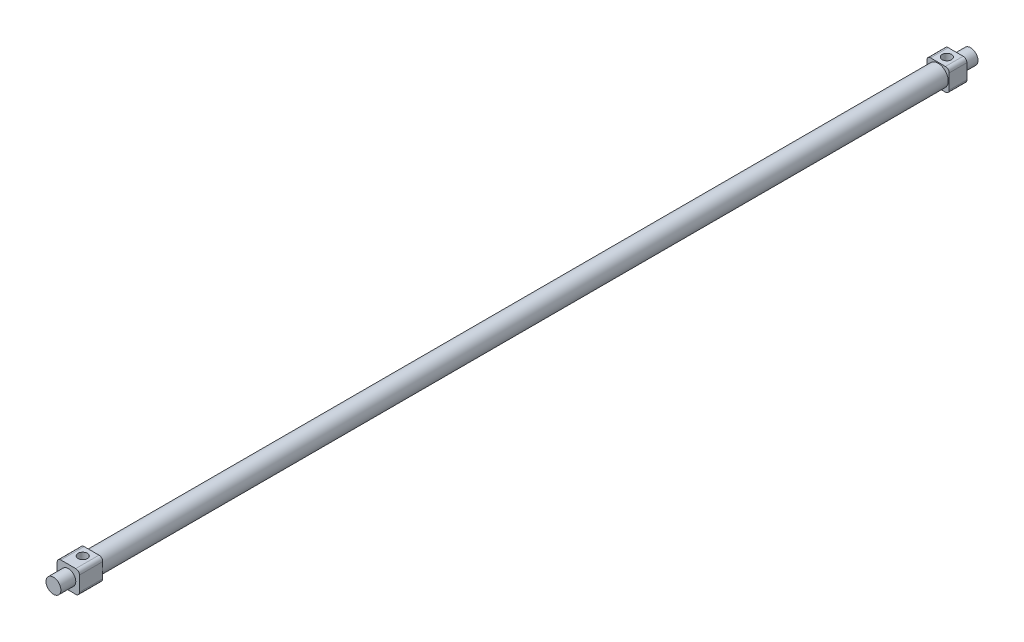
ISO-10303-21;
HEADER;
FILE_DESCRIPTION(('STEP AP214'),'2;1');
FILE_NAME('part.step','',(''),(''),'','','');
FILE_SCHEMA(('AUTOMOTIVE_DESIGN { 1 0 10303 214 1 1 1 1 }'));
ENDSEC;
DATA;
#1=APPLICATION_CONTEXT('core data for automotive mechanical design processes');
#2=APPLICATION_PROTOCOL_DEFINITION('international standard','automotive_design',2000,#1);
#3=PRODUCT_CONTEXT('',#1,'mechanical');
#4=PRODUCT('Part','Part','',(#3));
#5=PRODUCT_RELATED_PRODUCT_CATEGORY('part','',(#4));
#6=PRODUCT_DEFINITION_FORMATION('','',#4);
#7=PRODUCT_DEFINITION_CONTEXT('part definition',#1,'design');
#8=PRODUCT_DEFINITION('design','',#6,#7);
#9=PRODUCT_DEFINITION_SHAPE('','',#8);
#10=(LENGTH_UNIT() NAMED_UNIT(*) SI_UNIT(.MILLI.,.METRE.));
#11=(NAMED_UNIT(*) PLANE_ANGLE_UNIT() SI_UNIT($,.RADIAN.));
#12=(NAMED_UNIT(*) SI_UNIT($,.STERADIAN.) SOLID_ANGLE_UNIT());
#13=UNCERTAINTY_MEASURE_WITH_UNIT(LENGTH_MEASURE(1.E-05),#10,'distance_accuracy_value','');
#14=(GEOMETRIC_REPRESENTATION_CONTEXT(3) GLOBAL_UNCERTAINTY_ASSIGNED_CONTEXT((#13)) GLOBAL_UNIT_ASSIGNED_CONTEXT((#10,
#11,#12)) REPRESENTATION_CONTEXT('',''));
#15=CARTESIAN_POINT('',(0.,0.,0.));
#16=DIRECTION('',(0.,0.,1.));
#17=DIRECTION('',(1.,0.,0.));
#18=AXIS2_PLACEMENT_3D('',#15,#16,#17);
#19=CARTESIAN_POINT('',(0.,0.,477.));
#20=DIRECTION('',(0.,0.,-1.));
#21=DIRECTION('',(-1.,0.,0.));
#22=AXIS2_PLACEMENT_3D('',#19,#20,#21);
#23=PLANE('',#22);
#24=DIRECTION('',(0.,-1.,0.));
#25=VECTOR('',#24,1.);
#26=CARTESIAN_POINT('',(-6.,-6.,477.));
#27=LINE('',#26,#25);
#28=CARTESIAN_POINT('',(-6.,4.,477.));
#29=VERTEX_POINT('',#28);
#30=CARTESIAN_POINT('',(-6.,-4.,477.));
#31=VERTEX_POINT('',#30);
#32=EDGE_CURVE('E416',#29,#31,#27,.T.);
#33=ORIENTED_EDGE('',*,*,#32,.T.);
#34=CARTESIAN_POINT('',(-4.,-4.,477.));
#35=DIRECTION('',(0.,0.,-1.));
#36=DIRECTION('',(-1.,0.,0.));
#37=AXIS2_PLACEMENT_3D('',#34,#35,#36);
#38=CIRCLE('',#37,2.);
#39=CARTESIAN_POINT('',(-4.,-6.,477.));
#40=VERTEX_POINT('',#39);
#41=EDGE_CURVE('E250',#31,#40,#38,.F.);
#42=ORIENTED_EDGE('',*,*,#41,.T.);
#43=DIRECTION('',(1.,0.,0.));
#44=VECTOR('',#43,1.);
#45=CARTESIAN_POINT('',(-6.,-6.,477.));
#46=LINE('',#45,#44);
#47=CARTESIAN_POINT('',(4.,-6.,477.));
#48=VERTEX_POINT('',#47);
#49=EDGE_CURVE('E285',#40,#48,#46,.T.);
#50=ORIENTED_EDGE('',*,*,#49,.T.);
#51=CARTESIAN_POINT('',(4.,-4.,477.));
#52=DIRECTION('',(0.,0.,-1.));
#53=DIRECTION('',(-1.,0.,0.));
#54=AXIS2_PLACEMENT_3D('',#51,#52,#53);
#55=CIRCLE('',#54,2.);
#56=CARTESIAN_POINT('',(6.,-4.,477.));
#57=VERTEX_POINT('',#56);
#58=EDGE_CURVE('E248',#48,#57,#55,.F.);
#59=ORIENTED_EDGE('',*,*,#58,.T.);
#60=DIRECTION('',(0.,1.,0.));
#61=VECTOR('',#60,1.);
#62=CARTESIAN_POINT('',(6.,-6.,477.));
#63=LINE('',#62,#61);
#64=CARTESIAN_POINT('',(6.,4.,477.));
#65=VERTEX_POINT('',#64);
#66=EDGE_CURVE('E282',#57,#65,#63,.T.);
#67=ORIENTED_EDGE('',*,*,#66,.T.);
#68=CARTESIAN_POINT('',(4.,4.,477.));
#69=DIRECTION('',(0.,0.,-1.));
#70=DIRECTION('',(-1.,0.,0.));
#71=AXIS2_PLACEMENT_3D('',#68,#69,#70);
#72=CIRCLE('',#71,2.);
#73=CARTESIAN_POINT('',(4.,6.,477.));
#74=VERTEX_POINT('',#73);
#75=EDGE_CURVE('E62',#65,#74,#72,.F.);
#76=ORIENTED_EDGE('',*,*,#75,.T.);
#77=DIRECTION('',(-1.,0.,0.));
#78=VECTOR('',#77,1.);
#79=CARTESIAN_POINT('',(-6.,6.,477.));
#80=LINE('',#79,#78);
#81=CARTESIAN_POINT('',(-4.,6.,477.));
#82=VERTEX_POINT('',#81);
#83=EDGE_CURVE('E261',#74,#82,#80,.T.);
#84=ORIENTED_EDGE('',*,*,#83,.T.);
#85=CARTESIAN_POINT('',(-4.,4.,477.));
#86=DIRECTION('',(0.,0.,-1.));
#87=DIRECTION('',(-1.,0.,0.));
#88=AXIS2_PLACEMENT_3D('',#85,#86,#87);
#89=CIRCLE('',#88,2.);
#90=EDGE_CURVE('E245',#82,#29,#89,.F.);
#91=ORIENTED_EDGE('',*,*,#90,.T.);
#92=EDGE_LOOP('',(#33,#42,#50,#59,#67,#76,#84,#91));
#93=FACE_BOUND('',#92,.T.);
#94=CARTESIAN_POINT('',(0.,0.,477.));
#95=DIRECTION('',(0.,0.,-1.));
#96=DIRECTION('',(-1.,0.,0.));
#97=AXIS2_PLACEMENT_3D('',#94,#95,#96);
#98=CIRCLE('',#97,4.);
#99=CARTESIAN_POINT('',(-4.,0.,477.));
#100=VERTEX_POINT('',#99);
#101=EDGE_CURVE('E198',#100,#100,#98,.F.);
#102=ORIENTED_EDGE('',*,*,#101,.F.);
#103=EDGE_LOOP('',(#102));
#104=FACE_BOUND('',#103,.T.);
#105=ADVANCED_FACE('F39',(#93,#104),#23,.F.);
#106=CARTESIAN_POINT('',(0.,0.,9.5));
#107=DIRECTION('',(0.,0.,-1.));
#108=DIRECTION('',(-1.,0.,0.));
#109=AXIS2_PLACEMENT_3D('',#106,#107,#108);
#110=PLANE('',#109);
#111=DIRECTION('',(0.,1.,0.));
#112=VECTOR('',#111,1.);
#113=CARTESIAN_POINT('',(6.,-6.,9.5));
#114=LINE('',#113,#112);
#115=CARTESIAN_POINT('',(6.,-4.,9.5));
#116=VERTEX_POINT('',#115);
#117=CARTESIAN_POINT('',(6.,4.,9.5));
#118=VERTEX_POINT('',#117);
#119=EDGE_CURVE('E194',#116,#118,#114,.T.);
#120=ORIENTED_EDGE('',*,*,#119,.T.);
#121=CARTESIAN_POINT('',(4.,4.,9.5));
#122=DIRECTION('',(0.,0.,-1.));
#123=DIRECTION('',(-1.,0.,0.));
#124=AXIS2_PLACEMENT_3D('',#121,#122,#123);
#125=CIRCLE('',#124,2.);
#126=CARTESIAN_POINT('',(4.,6.,9.5));
#127=VERTEX_POINT('',#126);
#128=EDGE_CURVE('E215',#118,#127,#125,.F.);
#129=ORIENTED_EDGE('',*,*,#128,.T.);
#130=DIRECTION('',(-1.,0.,0.));
#131=VECTOR('',#130,1.);
#132=CARTESIAN_POINT('',(-6.,6.,9.5));
#133=LINE('',#132,#131);
#134=CARTESIAN_POINT('',(-4.,6.,9.5));
#135=VERTEX_POINT('',#134);
#136=EDGE_CURVE('E175',#127,#135,#133,.T.);
#137=ORIENTED_EDGE('',*,*,#136,.T.);
#138=CARTESIAN_POINT('',(-4.,4.,9.5));
#139=DIRECTION('',(0.,0.,-1.));
#140=DIRECTION('',(-1.,0.,0.));
#141=AXIS2_PLACEMENT_3D('',#138,#139,#140);
#142=CIRCLE('',#141,2.);
#143=CARTESIAN_POINT('',(-6.,4.,9.5));
#144=VERTEX_POINT('',#143);
#145=EDGE_CURVE('E211',#135,#144,#142,.F.);
#146=ORIENTED_EDGE('',*,*,#145,.T.);
#147=DIRECTION('',(0.,-1.,0.));
#148=VECTOR('',#147,1.);
#149=CARTESIAN_POINT('',(-6.,-6.,9.5));
#150=LINE('',#149,#148);
#151=CARTESIAN_POINT('',(-6.,-4.,9.5));
#152=VERTEX_POINT('',#151);
#153=EDGE_CURVE('E289',#144,#152,#150,.T.);
#154=ORIENTED_EDGE('',*,*,#153,.T.);
#155=CARTESIAN_POINT('',(-4.,-4.,9.5));
#156=DIRECTION('',(0.,0.,-1.));
#157=DIRECTION('',(-1.,0.,0.));
#158=AXIS2_PLACEMENT_3D('',#155,#156,#157);
#159=CIRCLE('',#158,2.);
#160=CARTESIAN_POINT('',(-4.,-6.,9.5));
#161=VERTEX_POINT('',#160);
#162=EDGE_CURVE('E209',#152,#161,#159,.F.);
#163=ORIENTED_EDGE('',*,*,#162,.T.);
#164=DIRECTION('',(1.,0.,0.));
#165=VECTOR('',#164,1.);
#166=CARTESIAN_POINT('',(-6.,-6.,9.5));
#167=LINE('',#166,#165);
#168=CARTESIAN_POINT('',(4.,-6.,9.5));
#169=VERTEX_POINT('',#168);
#170=EDGE_CURVE('E199',#161,#169,#167,.T.);
#171=ORIENTED_EDGE('',*,*,#170,.T.);
#172=CARTESIAN_POINT('',(4.,-4.,9.5));
#173=DIRECTION('',(0.,0.,-1.));
#174=DIRECTION('',(-1.,0.,0.));
#175=AXIS2_PLACEMENT_3D('',#172,#173,#174);
#176=CIRCLE('',#175,2.);
#177=EDGE_CURVE('E213',#169,#116,#176,.F.);
#178=ORIENTED_EDGE('',*,*,#177,.T.);
#179=EDGE_LOOP('',(#120,#129,#137,#146,#154,#163,#171,#178));
#180=FACE_BOUND('',#179,.T.);
#181=CARTESIAN_POINT('',(0.,0.,9.50000000000001));
#182=DIRECTION('',(0.,0.,-1.));
#183=DIRECTION('',(-1.,0.,0.));
#184=AXIS2_PLACEMENT_3D('',#181,#182,#183);
#185=CIRCLE('',#184,5.5);
#186=CARTESIAN_POINT('',(-5.5,0.,9.50000000000001));
#187=VERTEX_POINT('',#186);
#188=EDGE_CURVE('E195',#187,#187,#185,.F.);
#189=ORIENTED_EDGE('',*,*,#188,.F.);
#190=EDGE_LOOP('',(#189));
#191=FACE_BOUND('',#190,.T.);
#192=ADVANCED_FACE('F295',(#180,#191),#110,.F.);
#193=CARTESIAN_POINT('',(6.,-6.,9.5));
#194=DIRECTION('',(-1.,0.,0.));
#195=DIRECTION('',(0.,0.,1.));
#196=AXIS2_PLACEMENT_3D('',#193,#194,#195);
#197=PLANE('',#196);
#198=DIRECTION('',(0.,1.,0.));
#199=VECTOR('',#198,1.);
#200=CARTESIAN_POINT('',(6.,-6.,0.));
#201=LINE('',#200,#199);
#202=CARTESIAN_POINT('',(6.,-4.,0.));
#203=VERTEX_POINT('',#202);
#204=CARTESIAN_POINT('',(6.,4.,0.));
#205=VERTEX_POINT('',#204);
#206=EDGE_CURVE('E183',#203,#205,#201,.T.);
#207=ORIENTED_EDGE('',*,*,#206,.T.);
#208=DIRECTION('',(0.,0.,-1.));
#209=VECTOR('',#208,1.);
#210=CARTESIAN_POINT('',(6.,4.,9.5));
#211=LINE('',#210,#209);
#212=EDGE_CURVE('E160',#205,#118,#211,.F.);
#213=ORIENTED_EDGE('',*,*,#212,.T.);
#214=ORIENTED_EDGE('',*,*,#119,.F.);
#215=DIRECTION('',(0.,0.,-1.));
#216=VECTOR('',#215,1.);
#217=CARTESIAN_POINT('',(6.,-4.,9.5));
#218=LINE('',#217,#216);
#219=EDGE_CURVE('E165',#116,#203,#218,.T.);
#220=ORIENTED_EDGE('',*,*,#219,.T.);
#221=EDGE_LOOP('',(#207,#213,#214,#220));
#222=FACE_BOUND('',#221,.T.);
#223=ADVANCED_FACE('F306',(#222),#197,.F.);
#224=CARTESIAN_POINT('',(-6.,6.,9.5));
#225=DIRECTION('',(0.,-1.,0.));
#226=DIRECTION('',(0.,0.,-1.));
#227=AXIS2_PLACEMENT_3D('',#224,#225,#226);
#228=PLANE('',#227);
#229=CARTESIAN_POINT('',(0.,6.,4.75));
#230=DIRECTION('',(0.,1.,0.));
#231=DIRECTION('',(0.,0.,1.));
#232=AXIS2_PLACEMENT_3D('',#229,#230,#231);
#233=CIRCLE('',#232,2.5);
#234=CARTESIAN_POINT('',(0.,6.,7.25));
#235=VERTEX_POINT('',#234);
#236=EDGE_CURVE('E410',#235,#235,#233,.T.);
#237=ORIENTED_EDGE('',*,*,#236,.F.);
#238=EDGE_LOOP('',(#237));
#239=FACE_BOUND('',#238,.T.);
#240=ORIENTED_EDGE('',*,*,#136,.F.);
#241=DIRECTION('',(0.,0.,-1.));
#242=VECTOR('',#241,1.);
#243=CARTESIAN_POINT('',(4.,6.,9.5));
#244=LINE('',#243,#242);
#245=CARTESIAN_POINT('',(4.,6.,0.));
#246=VERTEX_POINT('',#245);
#247=EDGE_CURVE('E159',#127,#246,#244,.T.);
#248=ORIENTED_EDGE('',*,*,#247,.T.);
#249=DIRECTION('',(-1.,0.,0.));
#250=VECTOR('',#249,1.);
#251=CARTESIAN_POINT('',(-6.,6.,0.));
#252=LINE('',#251,#250);
#253=CARTESIAN_POINT('',(-4.,6.,0.));
#254=VERTEX_POINT('',#253);
#255=EDGE_CURVE('E172',#246,#254,#252,.T.);
#256=ORIENTED_EDGE('',*,*,#255,.T.);
#257=DIRECTION('',(0.,0.,-1.));
#258=VECTOR('',#257,1.);
#259=CARTESIAN_POINT('',(-4.,6.,9.5));
#260=LINE('',#259,#258);
#261=EDGE_CURVE('E177',#254,#135,#260,.F.);
#262=ORIENTED_EDGE('',*,*,#261,.T.);
#263=EDGE_LOOP('',(#240,#248,#256,#262));
#264=FACE_BOUND('',#263,.T.);
#265=ADVANCED_FACE('F171',(#239,#264),#228,.F.);
#266=CARTESIAN_POINT('',(-6.,-6.,9.5));
#267=DIRECTION('',(1.,0.,0.));
#268=DIRECTION('',(0.,0.,-1.));
#269=AXIS2_PLACEMENT_3D('',#266,#267,#268);
#270=PLANE('',#269);
#271=ORIENTED_EDGE('',*,*,#153,.F.);
#272=DIRECTION('',(0.,0.,-1.));
#273=VECTOR('',#272,1.);
#274=CARTESIAN_POINT('',(-6.,4.,9.5));
#275=LINE('',#274,#273);
#276=CARTESIAN_POINT('',(-6.,4.,0.));
#277=VERTEX_POINT('',#276);
#278=EDGE_CURVE('E224',#144,#277,#275,.T.);
#279=ORIENTED_EDGE('',*,*,#278,.T.);
#280=DIRECTION('',(0.,-1.,0.));
#281=VECTOR('',#280,1.);
#282=CARTESIAN_POINT('',(-6.,-6.,0.));
#283=LINE('',#282,#281);
#284=CARTESIAN_POINT('',(-6.,-4.,0.));
#285=VERTEX_POINT('',#284);
#286=EDGE_CURVE('E182',#277,#285,#283,.T.);
#287=ORIENTED_EDGE('',*,*,#286,.T.);
#288=DIRECTION('',(0.,0.,-1.));
#289=VECTOR('',#288,1.);
#290=CARTESIAN_POINT('',(-6.,-4.,9.5));
#291=LINE('',#290,#289);
#292=EDGE_CURVE('E222',#285,#152,#291,.F.);
#293=ORIENTED_EDGE('',*,*,#292,.T.);
#294=EDGE_LOOP('',(#271,#279,#287,#293));
#295=FACE_BOUND('',#294,.T.);
#296=ADVANCED_FACE('F314',(#295),#270,.F.);
#297=CARTESIAN_POINT('',(-6.,-6.,9.5));
#298=DIRECTION('',(0.,1.,0.));
#299=DIRECTION('',(0.,0.,1.));
#300=AXIS2_PLACEMENT_3D('',#297,#298,#299);
#301=PLANE('',#300);
#302=DIRECTION('',(1.,0.,0.));
#303=VECTOR('',#302,1.);
#304=CARTESIAN_POINT('',(-6.,-6.,0.));
#305=LINE('',#304,#303);
#306=CARTESIAN_POINT('',(-4.,-6.,0.));
#307=VERTEX_POINT('',#306);
#308=CARTESIAN_POINT('',(4.,-6.,0.));
#309=VERTEX_POINT('',#308);
#310=EDGE_CURVE('E186',#307,#309,#305,.T.);
#311=ORIENTED_EDGE('',*,*,#310,.T.);
#312=DIRECTION('',(0.,0.,-1.));
#313=VECTOR('',#312,1.);
#314=CARTESIAN_POINT('',(4.,-6.,9.5));
#315=LINE('',#314,#313);
#316=EDGE_CURVE('E220',#309,#169,#315,.F.);
#317=ORIENTED_EDGE('',*,*,#316,.T.);
#318=ORIENTED_EDGE('',*,*,#170,.F.);
#319=DIRECTION('',(0.,0.,-1.));
#320=VECTOR('',#319,1.);
#321=CARTESIAN_POINT('',(-4.,-6.,9.5));
#322=LINE('',#321,#320);
#323=EDGE_CURVE('E217',#161,#307,#322,.T.);
#324=ORIENTED_EDGE('',*,*,#323,.T.);
#325=EDGE_LOOP('',(#311,#317,#318,#324));
#326=FACE_BOUND('',#325,.T.);
#327=ADVANCED_FACE('F308',(#326),#301,.F.);
#328=CARTESIAN_POINT('',(0.,0.,0.));
#329=DIRECTION('',(0.,0.,-1.));
#330=DIRECTION('',(-1.,0.,0.));
#331=AXIS2_PLACEMENT_3D('',#328,#329,#330);
#332=PLANE('',#331);
#333=CARTESIAN_POINT('',(0.,0.,0.));
#334=DIRECTION('',(0.,0.,-1.));
#335=DIRECTION('',(-1.,0.,0.));
#336=AXIS2_PLACEMENT_3D('',#333,#334,#335);
#337=CIRCLE('',#336,4.);
#338=CARTESIAN_POINT('',(-4.,0.,0.));
#339=VERTEX_POINT('',#338);
#340=EDGE_CURVE('E11',#339,#339,#337,.T.);
#341=ORIENTED_EDGE('',*,*,#340,.F.);
#342=EDGE_LOOP('',(#341));
#343=FACE_BOUND('',#342,.T.);
#344=ORIENTED_EDGE('',*,*,#255,.F.);
#345=CARTESIAN_POINT('',(4.,4.,0.));
#346=DIRECTION('',(0.,0.,-1.));
#347=DIRECTION('',(-1.,0.,0.));
#348=AXIS2_PLACEMENT_3D('',#345,#346,#347);
#349=CIRCLE('',#348,2.);
#350=EDGE_CURVE('E155',#246,#205,#349,.T.);
#351=ORIENTED_EDGE('',*,*,#350,.T.);
#352=ORIENTED_EDGE('',*,*,#206,.F.);
#353=CARTESIAN_POINT('',(4.,-4.,0.));
#354=DIRECTION('',(0.,0.,-1.));
#355=DIRECTION('',(-1.,0.,0.));
#356=AXIS2_PLACEMENT_3D('',#353,#354,#355);
#357=CIRCLE('',#356,2.);
#358=EDGE_CURVE('E166',#203,#309,#357,.T.);
#359=ORIENTED_EDGE('',*,*,#358,.T.);
#360=ORIENTED_EDGE('',*,*,#310,.F.);
#361=CARTESIAN_POINT('',(-4.,-4.,0.));
#362=DIRECTION('',(0.,0.,-1.));
#363=DIRECTION('',(-1.,0.,0.));
#364=AXIS2_PLACEMENT_3D('',#361,#362,#363);
#365=CIRCLE('',#364,2.);
#366=EDGE_CURVE('E176',#307,#285,#365,.T.);
#367=ORIENTED_EDGE('',*,*,#366,.T.);
#368=ORIENTED_EDGE('',*,*,#286,.F.);
#369=CARTESIAN_POINT('',(-4.,4.,0.));
#370=DIRECTION('',(0.,0.,-1.));
#371=DIRECTION('',(-1.,0.,0.));
#372=AXIS2_PLACEMENT_3D('',#369,#370,#371);
#373=CIRCLE('',#372,2.);
#374=EDGE_CURVE('E181',#277,#254,#373,.T.);
#375=ORIENTED_EDGE('',*,*,#374,.T.);
#376=EDGE_LOOP('',(#344,#351,#352,#359,#360,#367,#368,#375));
#377=FACE_BOUND('',#376,.T.);
#378=ADVANCED_FACE('F179',(#343,#377),#332,.T.);
#379=CARTESIAN_POINT('',(0.,0.,464.5));
#380=DIRECTION('',(0.,0.,-1.));
#381=DIRECTION('',(-1.,0.,0.));
#382=AXIS2_PLACEMENT_3D('',#379,#380,#381);
#383=CYLINDRICAL_SURFACE('',#382,5.5);
#384=CARTESIAN_POINT('',(0.,0.,464.5));
#385=DIRECTION('',(0.,0.,1.));
#386=DIRECTION('',(1.,0.,0.));
#387=AXIS2_PLACEMENT_3D('',#384,#385,#386);
#388=CIRCLE('',#387,5.5);
#389=CARTESIAN_POINT('',(5.5,0.,464.5));
#390=VERTEX_POINT('',#389);
#391=EDGE_CURVE('E188',#390,#390,#388,.T.);
#392=ORIENTED_EDGE('',*,*,#391,.F.);
#393=EDGE_LOOP('',(#392));
#394=FACE_BOUND('',#393,.T.);
#395=ORIENTED_EDGE('',*,*,#188,.T.);
#396=EDGE_LOOP('',(#395));
#397=FACE_BOUND('',#396,.T.);
#398=ADVANCED_FACE('F343',(#394,#397),#383,.T.);
#399=CARTESIAN_POINT('',(0.,0.,464.5));
#400=DIRECTION('',(0.,0.,-1.));
#401=DIRECTION('',(-1.,0.,0.));
#402=AXIS2_PLACEMENT_3D('',#399,#400,#401);
#403=PLANE('',#402);
#404=DIRECTION('',(1.,0.,0.));
#405=VECTOR('',#404,1.);
#406=CARTESIAN_POINT('',(-6.,-6.,464.5));
#407=LINE('',#406,#405);
#408=CARTESIAN_POINT('',(-4.,-6.,464.5));
#409=VERTEX_POINT('',#408);
#410=CARTESIAN_POINT('',(4.,-6.,464.5));
#411=VERTEX_POINT('',#410);
#412=EDGE_CURVE('E274',#409,#411,#407,.T.);
#413=ORIENTED_EDGE('',*,*,#412,.F.);
#414=CARTESIAN_POINT('',(-4.,-4.,464.5));
#415=DIRECTION('',(0.,0.,-1.));
#416=DIRECTION('',(-1.,0.,0.));
#417=AXIS2_PLACEMENT_3D('',#414,#415,#416);
#418=CIRCLE('',#417,2.);
#419=CARTESIAN_POINT('',(-6.,-4.,464.5));
#420=VERTEX_POINT('',#419);
#421=EDGE_CURVE('E238',#409,#420,#418,.T.);
#422=ORIENTED_EDGE('',*,*,#421,.T.);
#423=DIRECTION('',(0.,-1.,0.));
#424=VECTOR('',#423,1.);
#425=CARTESIAN_POINT('',(-6.,-6.,464.5));
#426=LINE('',#425,#424);
#427=CARTESIAN_POINT('',(-6.,4.,464.5));
#428=VERTEX_POINT('',#427);
#429=EDGE_CURVE('E270',#428,#420,#426,.T.);
#430=ORIENTED_EDGE('',*,*,#429,.F.);
#431=CARTESIAN_POINT('',(-4.,4.,464.5));
#432=DIRECTION('',(0.,0.,-1.));
#433=DIRECTION('',(-1.,0.,0.));
#434=AXIS2_PLACEMENT_3D('',#431,#432,#433);
#435=CIRCLE('',#434,2.);
#436=CARTESIAN_POINT('',(-4.,6.,464.5));
#437=VERTEX_POINT('',#436);
#438=EDGE_CURVE('E232',#428,#437,#435,.T.);
#439=ORIENTED_EDGE('',*,*,#438,.T.);
#440=DIRECTION('',(-1.,0.,0.));
#441=VECTOR('',#440,1.);
#442=CARTESIAN_POINT('',(-6.,6.,464.5));
#443=LINE('',#442,#441);
#444=CARTESIAN_POINT('',(4.,6.,464.5));
#445=VERTEX_POINT('',#444);
#446=EDGE_CURVE('E260',#445,#437,#443,.T.);
#447=ORIENTED_EDGE('',*,*,#446,.F.);
#448=CARTESIAN_POINT('',(4.,4.,464.5));
#449=DIRECTION('',(0.,0.,-1.));
#450=DIRECTION('',(-1.,0.,0.));
#451=AXIS2_PLACEMENT_3D('',#448,#449,#450);
#452=CIRCLE('',#451,2.);
#453=CARTESIAN_POINT('',(6.,4.,464.5));
#454=VERTEX_POINT('',#453);
#455=EDGE_CURVE('E234',#445,#454,#452,.T.);
#456=ORIENTED_EDGE('',*,*,#455,.T.);
#457=DIRECTION('',(0.,1.,0.));
#458=VECTOR('',#457,1.);
#459=CARTESIAN_POINT('',(6.,-6.,464.5));
#460=LINE('',#459,#458);
#461=CARTESIAN_POINT('',(6.,-4.,464.5));
#462=VERTEX_POINT('',#461);
#463=EDGE_CURVE('E271',#462,#454,#460,.T.);
#464=ORIENTED_EDGE('',*,*,#463,.F.);
#465=CARTESIAN_POINT('',(4.,-4.,464.5));
#466=DIRECTION('',(0.,0.,-1.));
#467=DIRECTION('',(-1.,0.,0.));
#468=AXIS2_PLACEMENT_3D('',#465,#466,#467);
#469=CIRCLE('',#468,2.);
#470=EDGE_CURVE('E236',#462,#411,#469,.T.);
#471=ORIENTED_EDGE('',*,*,#470,.T.);
#472=EDGE_LOOP('',(#413,#422,#430,#439,#447,#456,#464,#471));
#473=FACE_BOUND('',#472,.T.);
#474=ORIENTED_EDGE('',*,*,#391,.T.);
#475=EDGE_LOOP('',(#474));
#476=FACE_BOUND('',#475,.T.);
#477=ADVANCED_FACE('F265',(#473,#476),#403,.T.);
#478=CARTESIAN_POINT('',(6.,-6.,477.));
#479=DIRECTION('',(-1.,0.,0.));
#480=DIRECTION('',(0.,0.,1.));
#481=AXIS2_PLACEMENT_3D('',#478,#479,#480);
#482=PLANE('',#481);
#483=ORIENTED_EDGE('',*,*,#66,.F.);
#484=DIRECTION('',(0.,0.,-1.));
#485=VECTOR('',#484,1.);
#486=CARTESIAN_POINT('',(6.,-4.,477.));
#487=LINE('',#486,#485);
#488=EDGE_CURVE('E254',#57,#462,#487,.T.);
#489=ORIENTED_EDGE('',*,*,#488,.T.);
#490=ORIENTED_EDGE('',*,*,#463,.T.);
#491=DIRECTION('',(0.,0.,-1.));
#492=VECTOR('',#491,1.);
#493=CARTESIAN_POINT('',(6.,4.,477.));
#494=LINE('',#493,#492);
#495=EDGE_CURVE('E252',#454,#65,#494,.F.);
#496=ORIENTED_EDGE('',*,*,#495,.T.);
#497=EDGE_LOOP('',(#483,#489,#490,#496));
#498=FACE_BOUND('',#497,.T.);
#499=ADVANCED_FACE('F342',(#498),#482,.F.);
#500=CARTESIAN_POINT('',(-6.,6.,477.));
#501=DIRECTION('',(0.,-1.,0.));
#502=DIRECTION('',(0.,0.,-1.));
#503=AXIS2_PLACEMENT_3D('',#500,#501,#502);
#504=PLANE('',#503);
#505=CARTESIAN_POINT('',(0.,6.,469.25));
#506=DIRECTION('',(0.,1.,0.));
#507=DIRECTION('',(0.,0.,1.));
#508=AXIS2_PLACEMENT_3D('',#505,#506,#507);
#509=CIRCLE('',#508,2.5);
#510=CARTESIAN_POINT('',(0.,6.,471.75));
#511=VERTEX_POINT('',#510);
#512=EDGE_CURVE('E496',#511,#511,#509,.T.);
#513=ORIENTED_EDGE('',*,*,#512,.F.);
#514=EDGE_LOOP('',(#513));
#515=FACE_BOUND('',#514,.T.);
#516=ORIENTED_EDGE('',*,*,#83,.F.);
#517=DIRECTION('',(0.,0.,-1.));
#518=VECTOR('',#517,1.);
#519=CARTESIAN_POINT('',(4.,6.,477.));
#520=LINE('',#519,#518);
#521=EDGE_CURVE('E43',#74,#445,#520,.T.);
#522=ORIENTED_EDGE('',*,*,#521,.T.);
#523=ORIENTED_EDGE('',*,*,#446,.T.);
#524=DIRECTION('',(0.,0.,-1.));
#525=VECTOR('',#524,1.);
#526=CARTESIAN_POINT('',(-4.,6.,477.));
#527=LINE('',#526,#525);
#528=EDGE_CURVE('E55',#437,#82,#527,.F.);
#529=ORIENTED_EDGE('',*,*,#528,.T.);
#530=EDGE_LOOP('',(#516,#522,#523,#529));
#531=FACE_BOUND('',#530,.T.);
#532=ADVANCED_FACE('F259',(#515,#531),#504,.F.);
#533=CARTESIAN_POINT('',(-6.,-6.,477.));
#534=DIRECTION('',(1.,0.,0.));
#535=DIRECTION('',(0.,0.,-1.));
#536=AXIS2_PLACEMENT_3D('',#533,#534,#535);
#537=PLANE('',#536);
#538=ORIENTED_EDGE('',*,*,#429,.T.);
#539=DIRECTION('',(0.,0.,-1.));
#540=VECTOR('',#539,1.);
#541=CARTESIAN_POINT('',(-6.,-4.,477.));
#542=LINE('',#541,#540);
#543=EDGE_CURVE('E243',#420,#31,#542,.F.);
#544=ORIENTED_EDGE('',*,*,#543,.T.);
#545=ORIENTED_EDGE('',*,*,#32,.F.);
#546=DIRECTION('',(0.,0.,-1.));
#547=VECTOR('',#546,1.);
#548=CARTESIAN_POINT('',(-6.,4.,477.));
#549=LINE('',#548,#547);
#550=EDGE_CURVE('E240',#29,#428,#549,.T.);
#551=ORIENTED_EDGE('',*,*,#550,.T.);
#552=EDGE_LOOP('',(#538,#544,#545,#551));
#553=FACE_BOUND('',#552,.T.);
#554=ADVANCED_FACE('F347',(#553),#537,.F.);
#555=CARTESIAN_POINT('',(-6.,-6.,477.));
#556=DIRECTION('',(0.,1.,0.));
#557=DIRECTION('',(0.,0.,1.));
#558=AXIS2_PLACEMENT_3D('',#555,#556,#557);
#559=PLANE('',#558);
#560=ORIENTED_EDGE('',*,*,#49,.F.);
#561=DIRECTION('',(0.,0.,-1.));
#562=VECTOR('',#561,1.);
#563=CARTESIAN_POINT('',(-4.,-6.,477.));
#564=LINE('',#563,#562);
#565=EDGE_CURVE('E229',#40,#409,#564,.T.);
#566=ORIENTED_EDGE('',*,*,#565,.T.);
#567=ORIENTED_EDGE('',*,*,#412,.T.);
#568=DIRECTION('',(0.,0.,-1.));
#569=VECTOR('',#568,1.);
#570=CARTESIAN_POINT('',(4.,-6.,477.));
#571=LINE('',#570,#569);
#572=EDGE_CURVE('E227',#411,#48,#571,.F.);
#573=ORIENTED_EDGE('',*,*,#572,.T.);
#574=EDGE_LOOP('',(#560,#566,#567,#573));
#575=FACE_BOUND('',#574,.T.);
#576=ADVANCED_FACE('F344',(#575),#559,.F.);
#577=CARTESIAN_POINT('',(0.,0.,485.));
#578=DIRECTION('',(0.,0.,-1.));
#579=DIRECTION('',(-1.,0.,0.));
#580=AXIS2_PLACEMENT_3D('',#577,#578,#579);
#581=CYLINDRICAL_SURFACE('',#580,4.);
#582=CARTESIAN_POINT('',(0.,0.,485.));
#583=DIRECTION('',(0.,0.,1.));
#584=DIRECTION('',(1.,0.,0.));
#585=AXIS2_PLACEMENT_3D('',#582,#583,#584);
#586=CIRCLE('',#585,4.);
#587=CARTESIAN_POINT('',(4.,0.,485.));
#588=VERTEX_POINT('',#587);
#589=EDGE_CURVE('E276',#588,#588,#586,.T.);
#590=ORIENTED_EDGE('',*,*,#589,.F.);
#591=EDGE_LOOP('',(#590));
#592=FACE_BOUND('',#591,.T.);
#593=ORIENTED_EDGE('',*,*,#101,.T.);
#594=EDGE_LOOP('',(#593));
#595=FACE_BOUND('',#594,.T.);
#596=ADVANCED_FACE('F338',(#592,#595),#581,.T.);
#597=CARTESIAN_POINT('',(0.,0.,485.));
#598=DIRECTION('',(0.,0.,1.));
#599=DIRECTION('',(1.,0.,0.));
#600=AXIS2_PLACEMENT_3D('',#597,#598,#599);
#601=PLANE('',#600);
#602=ORIENTED_EDGE('',*,*,#589,.T.);
#603=EDGE_LOOP('',(#602));
#604=FACE_BOUND('',#603,.T.);
#605=ADVANCED_FACE('F397',(#604),#601,.T.);
#606=CARTESIAN_POINT('',(0.,-7.07106781186548,4.75));
#607=DIRECTION('',(0.,1.,0.));
#608=DIRECTION('',(0.,0.,1.));
#609=AXIS2_PLACEMENT_3D('',#606,#607,#608);
#610=CYLINDRICAL_SURFACE('',#609,2.5);
#611=CARTESIAN_POINT('',(0.,0.,4.75));
#612=DIRECTION('',(0.,1.,0.));
#613=DIRECTION('',(0.,0.,1.));
#614=AXIS2_PLACEMENT_3D('',#611,#612,#613);
#615=CIRCLE('',#614,2.5);
#616=CARTESIAN_POINT('',(0.,0.,7.25));
#617=VERTEX_POINT('',#616);
#618=EDGE_CURVE('E407',#617,#617,#615,.F.);
#619=ORIENTED_EDGE('',*,*,#618,.T.);
#620=EDGE_LOOP('',(#619));
#621=FACE_BOUND('',#620,.T.);
#622=ORIENTED_EDGE('',*,*,#236,.T.);
#623=EDGE_LOOP('',(#622));
#624=FACE_BOUND('',#623,.T.);
#625=ADVANCED_FACE('F394',(#621,#624),#610,.F.);
#626=CARTESIAN_POINT('',(0.,0.,0.));
#627=DIRECTION('',(0.,1.,0.));
#628=DIRECTION('',(0.,0.,1.));
#629=AXIS2_PLACEMENT_3D('',#626,#627,#628);
#630=PLANE('',#629);
#631=ORIENTED_EDGE('',*,*,#618,.F.);
#632=EDGE_LOOP('',(#631));
#633=FACE_BOUND('',#632,.T.);
#634=ADVANCED_FACE('F384',(#633),#630,.T.);
#635=CARTESIAN_POINT('',(0.,-7.07106781186548,469.25));
#636=DIRECTION('',(0.,1.,0.));
#637=DIRECTION('',(0.,0.,1.));
#638=AXIS2_PLACEMENT_3D('',#635,#636,#637);
#639=CYLINDRICAL_SURFACE('',#638,2.5);
#640=CARTESIAN_POINT('',(0.,0.,469.25));
#641=DIRECTION('',(0.,1.,0.));
#642=DIRECTION('',(0.,0.,1.));
#643=AXIS2_PLACEMENT_3D('',#640,#641,#642);
#644=CIRCLE('',#643,2.5);
#645=CARTESIAN_POINT('',(0.,0.,471.75));
#646=VERTEX_POINT('',#645);
#647=EDGE_CURVE('E499',#646,#646,#644,.F.);
#648=ORIENTED_EDGE('',*,*,#647,.T.);
#649=EDGE_LOOP('',(#648));
#650=FACE_BOUND('',#649,.T.);
#651=ORIENTED_EDGE('',*,*,#512,.T.);
#652=EDGE_LOOP('',(#651));
#653=FACE_BOUND('',#652,.T.);
#654=ADVANCED_FACE('F378',(#650,#653),#639,.F.);
#655=CARTESIAN_POINT('',(0.,0.,0.));
#656=DIRECTION('',(0.,1.,0.));
#657=DIRECTION('',(0.,0.,1.));
#658=AXIS2_PLACEMENT_3D('',#655,#656,#657);
#659=PLANE('',#658);
#660=ORIENTED_EDGE('',*,*,#647,.F.);
#661=EDGE_LOOP('',(#660));
#662=FACE_BOUND('',#661,.T.);
#663=ADVANCED_FACE('F374',(#662),#659,.T.);
#664=CARTESIAN_POINT('',(4.,4.,9.5));
#665=DIRECTION('',(0.,0.,-1.));
#666=DIRECTION('',(-1.,0.,0.));
#667=AXIS2_PLACEMENT_3D('',#664,#665,#666);
#668=CYLINDRICAL_SURFACE('',#667,2.);
#669=ORIENTED_EDGE('',*,*,#128,.F.);
#670=ORIENTED_EDGE('',*,*,#212,.F.);
#671=ORIENTED_EDGE('',*,*,#350,.F.);
#672=ORIENTED_EDGE('',*,*,#247,.F.);
#673=EDGE_LOOP('',(#669,#670,#671,#672));
#674=FACE_BOUND('',#673,.T.);
#675=ADVANCED_FACE('F158',(#674),#668,.T.);
#676=CARTESIAN_POINT('',(4.,-4.,9.5));
#677=DIRECTION('',(0.,0.,-1.));
#678=DIRECTION('',(-1.,0.,0.));
#679=AXIS2_PLACEMENT_3D('',#676,#677,#678);
#680=CYLINDRICAL_SURFACE('',#679,2.);
#681=ORIENTED_EDGE('',*,*,#177,.F.);
#682=ORIENTED_EDGE('',*,*,#316,.F.);
#683=ORIENTED_EDGE('',*,*,#358,.F.);
#684=ORIENTED_EDGE('',*,*,#219,.F.);
#685=EDGE_LOOP('',(#681,#682,#683,#684));
#686=FACE_BOUND('',#685,.T.);
#687=ADVANCED_FACE('F304',(#686),#680,.T.);
#688=CARTESIAN_POINT('',(-4.,4.,9.5));
#689=DIRECTION('',(0.,0.,-1.));
#690=DIRECTION('',(-1.,0.,0.));
#691=AXIS2_PLACEMENT_3D('',#688,#689,#690);
#692=CYLINDRICAL_SURFACE('',#691,2.);
#693=ORIENTED_EDGE('',*,*,#145,.F.);
#694=ORIENTED_EDGE('',*,*,#261,.F.);
#695=ORIENTED_EDGE('',*,*,#374,.F.);
#696=ORIENTED_EDGE('',*,*,#278,.F.);
#697=EDGE_LOOP('',(#693,#694,#695,#696));
#698=FACE_BOUND('',#697,.T.);
#699=ADVANCED_FACE('F318',(#698),#692,.T.);
#700=CARTESIAN_POINT('',(-4.,-4.,9.5));
#701=DIRECTION('',(0.,0.,-1.));
#702=DIRECTION('',(-1.,0.,0.));
#703=AXIS2_PLACEMENT_3D('',#700,#701,#702);
#704=CYLINDRICAL_SURFACE('',#703,2.);
#705=ORIENTED_EDGE('',*,*,#162,.F.);
#706=ORIENTED_EDGE('',*,*,#292,.F.);
#707=ORIENTED_EDGE('',*,*,#366,.F.);
#708=ORIENTED_EDGE('',*,*,#323,.F.);
#709=EDGE_LOOP('',(#705,#706,#707,#708));
#710=FACE_BOUND('',#709,.T.);
#711=ADVANCED_FACE('F310',(#710),#704,.T.);
#712=CARTESIAN_POINT('',(-4.,-4.,477.));
#713=DIRECTION('',(0.,0.,-1.));
#714=DIRECTION('',(-1.,0.,0.));
#715=AXIS2_PLACEMENT_3D('',#712,#713,#714);
#716=CYLINDRICAL_SURFACE('',#715,2.);
#717=ORIENTED_EDGE('',*,*,#41,.F.);
#718=ORIENTED_EDGE('',*,*,#543,.F.);
#719=ORIENTED_EDGE('',*,*,#421,.F.);
#720=ORIENTED_EDGE('',*,*,#565,.F.);
#721=EDGE_LOOP('',(#717,#718,#719,#720));
#722=FACE_BOUND('',#721,.T.);
#723=ADVANCED_FACE('F325',(#722),#716,.T.);
#724=CARTESIAN_POINT('',(4.,-4.,477.));
#725=DIRECTION('',(0.,0.,-1.));
#726=DIRECTION('',(-1.,0.,0.));
#727=AXIS2_PLACEMENT_3D('',#724,#725,#726);
#728=CYLINDRICAL_SURFACE('',#727,2.);
#729=ORIENTED_EDGE('',*,*,#58,.F.);
#730=ORIENTED_EDGE('',*,*,#572,.F.);
#731=ORIENTED_EDGE('',*,*,#470,.F.);
#732=ORIENTED_EDGE('',*,*,#488,.F.);
#733=EDGE_LOOP('',(#729,#730,#731,#732));
#734=FACE_BOUND('',#733,.T.);
#735=ADVANCED_FACE('F426',(#734),#728,.T.);
#736=CARTESIAN_POINT('',(4.,4.,477.));
#737=DIRECTION('',(0.,0.,-1.));
#738=DIRECTION('',(-1.,0.,0.));
#739=AXIS2_PLACEMENT_3D('',#736,#737,#738);
#740=CYLINDRICAL_SURFACE('',#739,2.);
#741=ORIENTED_EDGE('',*,*,#75,.F.);
#742=ORIENTED_EDGE('',*,*,#495,.F.);
#743=ORIENTED_EDGE('',*,*,#455,.F.);
#744=ORIENTED_EDGE('',*,*,#521,.F.);
#745=EDGE_LOOP('',(#741,#742,#743,#744));
#746=FACE_BOUND('',#745,.T.);
#747=ADVANCED_FACE('F435',(#746),#740,.T.);
#748=CARTESIAN_POINT('',(-4.,4.,477.));
#749=DIRECTION('',(0.,0.,-1.));
#750=DIRECTION('',(-1.,0.,0.));
#751=AXIS2_PLACEMENT_3D('',#748,#749,#750);
#752=CYLINDRICAL_SURFACE('',#751,2.);
#753=ORIENTED_EDGE('',*,*,#90,.F.);
#754=ORIENTED_EDGE('',*,*,#528,.F.);
#755=ORIENTED_EDGE('',*,*,#438,.F.);
#756=ORIENTED_EDGE('',*,*,#550,.F.);
#757=EDGE_LOOP('',(#753,#754,#755,#756));
#758=FACE_BOUND('',#757,.T.);
#759=ADVANCED_FACE('F41',(#758),#752,.T.);
#760=CARTESIAN_POINT('',(0.,0.,-8.));
#761=DIRECTION('',(0.,0.,1.));
#762=DIRECTION('',(1.,0.,0.));
#763=AXIS2_PLACEMENT_3D('',#760,#761,#762);
#764=CYLINDRICAL_SURFACE('',#763,4.);
#765=CARTESIAN_POINT('',(0.,0.,-8.));
#766=DIRECTION('',(0.,0.,-1.));
#767=DIRECTION('',(-1.,0.,0.));
#768=AXIS2_PLACEMENT_3D('',#765,#766,#767);
#769=CIRCLE('',#768,4.);
#770=CARTESIAN_POINT('',(-4.,0.,-8.));
#771=VERTEX_POINT('',#770);
#772=EDGE_CURVE('E495',#771,#771,#769,.T.);
#773=ORIENTED_EDGE('',*,*,#772,.F.);
#774=EDGE_LOOP('',(#773));
#775=FACE_BOUND('',#774,.T.);
#776=ORIENTED_EDGE('',*,*,#340,.T.);
#777=EDGE_LOOP('',(#776));
#778=FACE_BOUND('',#777,.T.);
#779=ADVANCED_FACE('F389',(#775,#778),#764,.T.);
#780=CARTESIAN_POINT('',(0.,0.,-8.));
#781=DIRECTION('',(0.,0.,-1.));
#782=DIRECTION('',(-1.,0.,0.));
#783=AXIS2_PLACEMENT_3D('',#780,#781,#782);
#784=PLANE('',#783);
#785=ORIENTED_EDGE('',*,*,#772,.T.);
#786=EDGE_LOOP('',(#785));
#787=FACE_BOUND('',#786,.T.);
#788=ADVANCED_FACE('F440',(#787),#784,.T.);
#789=CLOSED_SHELL('',(#105,#192,#223,#265,#296,#327,#378,#398,#477,#499,#532,#554,#576,#596,
#605,#625,#634,#654,#663,#675,#687,#699,#711,#723,#735,#747,#759,#779,#788));
#790=MANIFOLD_SOLID_BREP('B2',#789);
#791=ADVANCED_BREP_SHAPE_REPRESENTATION('',(#18,#790),#14);
#792=SHAPE_DEFINITION_REPRESENTATION(#9,#791);
ENDSEC;
END-ISO-10303-21;
